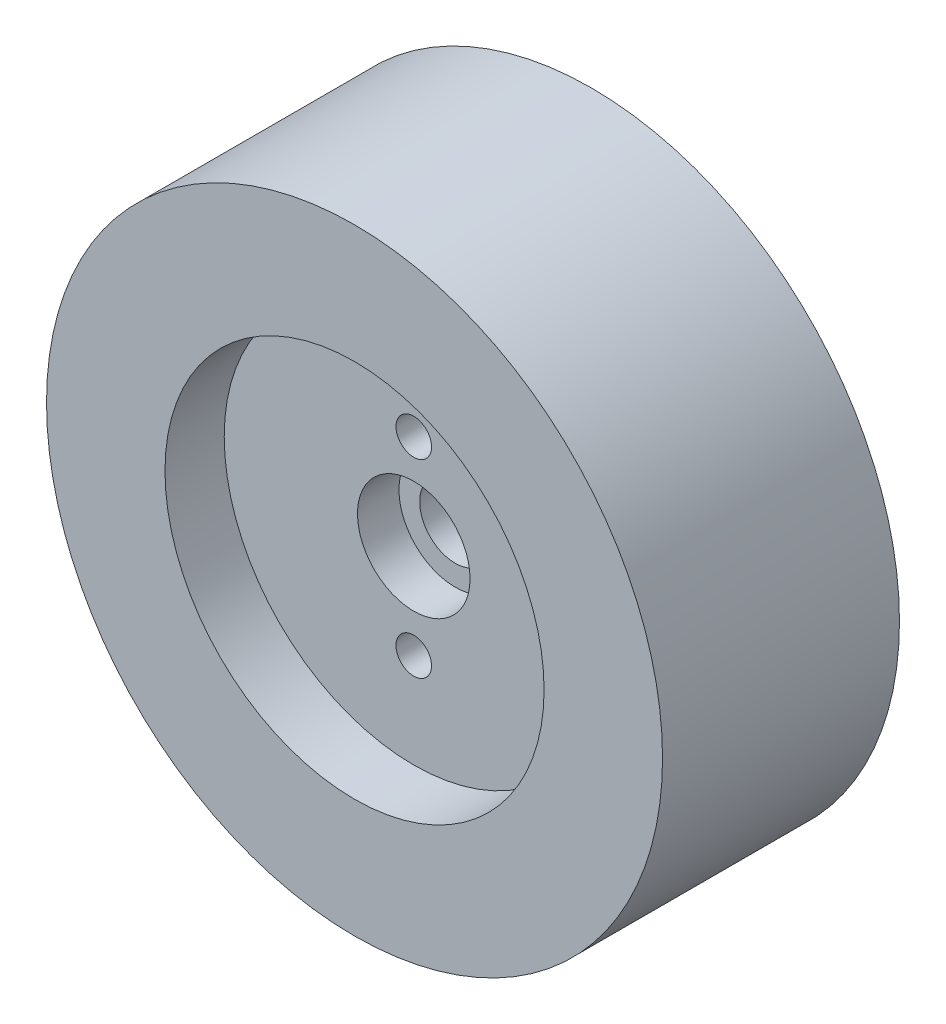
ISO-10303-21;
HEADER;
FILE_DESCRIPTION(('STEP AP214'),'2;1');
FILE_NAME('part.step','',(''),(''),'','','');
FILE_SCHEMA(('AUTOMOTIVE_DESIGN { 1 0 10303 214 1 1 1 1 }'));
ENDSEC;
DATA;
#1=APPLICATION_CONTEXT('core data for automotive mechanical design processes');
#2=APPLICATION_PROTOCOL_DEFINITION('international standard','automotive_design',2000,#1);
#3=PRODUCT_CONTEXT('',#1,'mechanical');
#4=PRODUCT('Part','Part','',(#3));
#5=PRODUCT_RELATED_PRODUCT_CATEGORY('part','',(#4));
#6=PRODUCT_DEFINITION_FORMATION('','',#4);
#7=PRODUCT_DEFINITION_CONTEXT('part definition',#1,'design');
#8=PRODUCT_DEFINITION('design','',#6,#7);
#9=PRODUCT_DEFINITION_SHAPE('','',#8);
#10=(LENGTH_UNIT() NAMED_UNIT(*) SI_UNIT(.MILLI.,.METRE.));
#11=(NAMED_UNIT(*) PLANE_ANGLE_UNIT() SI_UNIT($,.RADIAN.));
#12=(NAMED_UNIT(*) SI_UNIT($,.STERADIAN.) SOLID_ANGLE_UNIT());
#13=UNCERTAINTY_MEASURE_WITH_UNIT(LENGTH_MEASURE(1.E-05),#10,'distance_accuracy_value','');
#14=(GEOMETRIC_REPRESENTATION_CONTEXT(3) GLOBAL_UNCERTAINTY_ASSIGNED_CONTEXT((#13)) GLOBAL_UNIT_ASSIGNED_CONTEXT((#10,
#11,#12)) REPRESENTATION_CONTEXT('',''));
#15=CARTESIAN_POINT('',(0.,0.,0.));
#16=DIRECTION('',(0.,0.,1.));
#17=DIRECTION('',(1.,0.,0.));
#18=AXIS2_PLACEMENT_3D('',#15,#16,#17);
#19=CARTESIAN_POINT('',(0.,0.,20.));
#20=DIRECTION('',(0.,0.,-1.));
#21=DIRECTION('',(-1.,0.,0.));
#22=AXIS2_PLACEMENT_3D('',#19,#20,#21);
#23=CYLINDRICAL_SURFACE('',#22,3.);
#24=CARTESIAN_POINT('',(0.,0.,0.));
#25=DIRECTION('',(0.,0.,1.));
#26=DIRECTION('',(1.,0.,0.));
#27=AXIS2_PLACEMENT_3D('',#24,#25,#26);
#28=CIRCLE('',#27,3.);
#29=CARTESIAN_POINT('',(3.,0.,0.));
#30=VERTEX_POINT('',#29);
#31=EDGE_CURVE('E45',#30,#30,#28,.T.);
#32=ORIENTED_EDGE('',*,*,#31,.F.);
#33=EDGE_LOOP('',(#32));
#34=FACE_BOUND('',#33,.T.);
#35=CARTESIAN_POINT('',(0.,0.,11.5));
#36=DIRECTION('',(0.,0.,1.));
#37=DIRECTION('',(1.,0.,0.));
#38=AXIS2_PLACEMENT_3D('',#35,#36,#37);
#39=CIRCLE('',#38,3.);
#40=CARTESIAN_POINT('',(3.,0.,11.5));
#41=VERTEX_POINT('',#40);
#42=EDGE_CURVE('E36',#41,#41,#39,.T.);
#43=ORIENTED_EDGE('',*,*,#42,.T.);
#44=EDGE_LOOP('',(#43));
#45=FACE_BOUND('',#44,.T.);
#46=ADVANCED_FACE('F32',(#34,#45),#23,.F.);
#47=CARTESIAN_POINT('',(0.,0.,20.));
#48=DIRECTION('',(0.,0.,1.));
#49=DIRECTION('',(1.,0.,0.));
#50=AXIS2_PLACEMENT_3D('',#47,#48,#49);
#51=PLANE('',#50);
#52=CARTESIAN_POINT('',(0.,0.,20.));
#53=DIRECTION('',(0.,0.,1.));
#54=DIRECTION('',(1.,0.,0.));
#55=AXIS2_PLACEMENT_3D('',#52,#53,#54);
#56=CIRCLE('',#55,16.);
#57=CARTESIAN_POINT('',(16.,0.,20.));
#58=VERTEX_POINT('',#57);
#59=EDGE_CURVE('E50',#58,#58,#56,.T.);
#60=ORIENTED_EDGE('',*,*,#59,.F.);
#61=EDGE_LOOP('',(#60));
#62=FACE_BOUND('',#61,.T.);
#63=CARTESIAN_POINT('',(0.,0.,20.));
#64=DIRECTION('',(0.,0.,1.));
#65=DIRECTION('',(1.,0.,0.));
#66=AXIS2_PLACEMENT_3D('',#63,#64,#65);
#67=CIRCLE('',#66,26.);
#68=CARTESIAN_POINT('',(26.,0.,20.));
#69=VERTEX_POINT('',#68);
#70=EDGE_CURVE('E10',#69,#69,#67,.T.);
#71=ORIENTED_EDGE('',*,*,#70,.T.);
#72=EDGE_LOOP('',(#71));
#73=FACE_BOUND('',#72,.T.);
#74=ADVANCED_FACE('F101',(#62,#73),#51,.T.);
#75=CARTESIAN_POINT('',(0.,0.,0.));
#76=DIRECTION('',(0.,0.,1.));
#77=DIRECTION('',(1.,0.,0.));
#78=AXIS2_PLACEMENT_3D('',#75,#76,#77);
#79=PLANE('',#78);
#80=CARTESIAN_POINT('',(0.,-8.,0.));
#81=DIRECTION('',(0.,0.,1.));
#82=DIRECTION('',(1.,0.,0.));
#83=AXIS2_PLACEMENT_3D('',#80,#81,#82);
#84=CIRCLE('',#83,1.5);
#85=CARTESIAN_POINT('',(1.5,-8.,0.));
#86=VERTEX_POINT('',#85);
#87=EDGE_CURVE('E65',#86,#86,#84,.T.);
#88=ORIENTED_EDGE('',*,*,#87,.T.);
#89=EDGE_LOOP('',(#88));
#90=FACE_BOUND('',#89,.T.);
#91=CARTESIAN_POINT('',(0.,8.,0.));
#92=DIRECTION('',(0.,0.,1.));
#93=DIRECTION('',(1.,0.,0.));
#94=AXIS2_PLACEMENT_3D('',#91,#92,#93);
#95=CIRCLE('',#94,1.5);
#96=CARTESIAN_POINT('',(1.5,8.,0.));
#97=VERTEX_POINT('',#96);
#98=EDGE_CURVE('E59',#97,#97,#95,.T.);
#99=ORIENTED_EDGE('',*,*,#98,.T.);
#100=EDGE_LOOP('',(#99));
#101=FACE_BOUND('',#100,.T.);
#102=CARTESIAN_POINT('',(0.,0.,0.));
#103=DIRECTION('',(0.,0.,1.));
#104=DIRECTION('',(1.,0.,0.));
#105=AXIS2_PLACEMENT_3D('',#102,#103,#104);
#106=CIRCLE('',#105,26.);
#107=CARTESIAN_POINT('',(26.,0.,0.));
#108=VERTEX_POINT('',#107);
#109=EDGE_CURVE('E40',#108,#108,#106,.T.);
#110=ORIENTED_EDGE('',*,*,#109,.F.);
#111=EDGE_LOOP('',(#110));
#112=FACE_BOUND('',#111,.T.);
#113=ORIENTED_EDGE('',*,*,#31,.T.);
#114=EDGE_LOOP('',(#113));
#115=FACE_BOUND('',#114,.T.);
#116=ADVANCED_FACE('F74',(#90,#101,#112,#115),#79,.F.);
#117=CARTESIAN_POINT('',(0.,0.,20.));
#118=DIRECTION('',(0.,0.,-1.));
#119=DIRECTION('',(-1.,0.,0.));
#120=AXIS2_PLACEMENT_3D('',#117,#118,#119);
#121=CYLINDRICAL_SURFACE('',#120,26.);
#122=ORIENTED_EDGE('',*,*,#70,.F.);
#123=EDGE_LOOP('',(#122));
#124=FACE_BOUND('',#123,.T.);
#125=ORIENTED_EDGE('',*,*,#109,.T.);
#126=EDGE_LOOP('',(#125));
#127=FACE_BOUND('',#126,.T.);
#128=ADVANCED_FACE('F34',(#124,#127),#121,.T.);
#129=CARTESIAN_POINT('',(0.,0.,15.));
#130=DIRECTION('',(0.,0.,1.));
#131=DIRECTION('',(1.,0.,0.));
#132=AXIS2_PLACEMENT_3D('',#129,#130,#131);
#133=CYLINDRICAL_SURFACE('',#132,16.);
#134=CARTESIAN_POINT('',(0.,0.,15.));
#135=DIRECTION('',(0.,0.,1.));
#136=DIRECTION('',(1.,0.,0.));
#137=AXIS2_PLACEMENT_3D('',#134,#135,#136);
#138=CIRCLE('',#137,16.);
#139=CARTESIAN_POINT('',(16.,0.,15.));
#140=VERTEX_POINT('',#139);
#141=EDGE_CURVE('E49',#140,#140,#138,.T.);
#142=ORIENTED_EDGE('',*,*,#141,.F.);
#143=EDGE_LOOP('',(#142));
#144=FACE_BOUND('',#143,.T.);
#145=ORIENTED_EDGE('',*,*,#59,.T.);
#146=EDGE_LOOP('',(#145));
#147=FACE_BOUND('',#146,.T.);
#148=ADVANCED_FACE('F88',(#144,#147),#133,.F.);
#149=CARTESIAN_POINT('',(0.,0.,15.));
#150=DIRECTION('',(0.,0.,1.));
#151=DIRECTION('',(1.,0.,0.));
#152=AXIS2_PLACEMENT_3D('',#149,#150,#151);
#153=PLANE('',#152);
#154=CARTESIAN_POINT('',(0.,-8.,15.));
#155=DIRECTION('',(0.,0.,1.));
#156=DIRECTION('',(1.,0.,0.));
#157=AXIS2_PLACEMENT_3D('',#154,#155,#156);
#158=CIRCLE('',#157,1.5);
#159=CARTESIAN_POINT('',(1.5,-8.,15.));
#160=VERTEX_POINT('',#159);
#161=EDGE_CURVE('E68',#160,#160,#158,.T.);
#162=ORIENTED_EDGE('',*,*,#161,.F.);
#163=EDGE_LOOP('',(#162));
#164=FACE_BOUND('',#163,.T.);
#165=CARTESIAN_POINT('',(0.,8.,15.));
#166=DIRECTION('',(0.,0.,1.));
#167=DIRECTION('',(1.,0.,0.));
#168=AXIS2_PLACEMENT_3D('',#165,#166,#167);
#169=CIRCLE('',#168,1.5);
#170=CARTESIAN_POINT('',(1.5,8.,15.));
#171=VERTEX_POINT('',#170);
#172=EDGE_CURVE('E62',#171,#171,#169,.T.);
#173=ORIENTED_EDGE('',*,*,#172,.F.);
#174=EDGE_LOOP('',(#173));
#175=FACE_BOUND('',#174,.T.);
#176=CARTESIAN_POINT('',(0.,0.,15.));
#177=DIRECTION('',(0.,0.,1.));
#178=DIRECTION('',(1.,0.,0.));
#179=AXIS2_PLACEMENT_3D('',#176,#177,#178);
#180=CIRCLE('',#179,4.75);
#181=CARTESIAN_POINT('',(4.75,0.,15.));
#182=VERTEX_POINT('',#181);
#183=EDGE_CURVE('E55',#182,#182,#180,.T.);
#184=ORIENTED_EDGE('',*,*,#183,.F.);
#185=EDGE_LOOP('',(#184));
#186=FACE_BOUND('',#185,.T.);
#187=ORIENTED_EDGE('',*,*,#141,.T.);
#188=EDGE_LOOP('',(#187));
#189=FACE_BOUND('',#188,.T.);
#190=ADVANCED_FACE('F84',(#164,#175,#186,#189),#153,.T.);
#191=CARTESIAN_POINT('',(0.,0.,11.5));
#192=DIRECTION('',(0.,0.,1.));
#193=DIRECTION('',(1.,0.,0.));
#194=AXIS2_PLACEMENT_3D('',#191,#192,#193);
#195=CYLINDRICAL_SURFACE('',#194,4.75);
#196=CARTESIAN_POINT('',(0.,0.,11.5));
#197=DIRECTION('',(0.,0.,1.));
#198=DIRECTION('',(1.,0.,0.));
#199=AXIS2_PLACEMENT_3D('',#196,#197,#198);
#200=CIRCLE('',#199,4.75);
#201=CARTESIAN_POINT('',(4.75,0.,11.5));
#202=VERTEX_POINT('',#201);
#203=EDGE_CURVE('E58',#202,#202,#200,.T.);
#204=ORIENTED_EDGE('',*,*,#203,.F.);
#205=EDGE_LOOP('',(#204));
#206=FACE_BOUND('',#205,.T.);
#207=ORIENTED_EDGE('',*,*,#183,.T.);
#208=EDGE_LOOP('',(#207));
#209=FACE_BOUND('',#208,.T.);
#210=ADVANCED_FACE('F87',(#206,#209),#195,.F.);
#211=CARTESIAN_POINT('',(0.,0.,11.5));
#212=DIRECTION('',(0.,0.,1.));
#213=DIRECTION('',(1.,0.,0.));
#214=AXIS2_PLACEMENT_3D('',#211,#212,#213);
#215=PLANE('',#214);
#216=ORIENTED_EDGE('',*,*,#42,.F.);
#217=EDGE_LOOP('',(#216));
#218=FACE_BOUND('',#217,.T.);
#219=ORIENTED_EDGE('',*,*,#203,.T.);
#220=EDGE_LOOP('',(#219));
#221=FACE_BOUND('',#220,.T.);
#222=ADVANCED_FACE('F113',(#218,#221),#215,.T.);
#223=CARTESIAN_POINT('',(0.,8.,0.));
#224=DIRECTION('',(0.,0.,1.));
#225=DIRECTION('',(1.,0.,0.));
#226=AXIS2_PLACEMENT_3D('',#223,#224,#225);
#227=CYLINDRICAL_SURFACE('',#226,1.5);
#228=ORIENTED_EDGE('',*,*,#98,.F.);
#229=EDGE_LOOP('',(#228));
#230=FACE_BOUND('',#229,.T.);
#231=ORIENTED_EDGE('',*,*,#172,.T.);
#232=EDGE_LOOP('',(#231));
#233=FACE_BOUND('',#232,.T.);
#234=ADVANCED_FACE('F80',(#230,#233),#227,.F.);
#235=CARTESIAN_POINT('',(0.,-8.,0.));
#236=DIRECTION('',(0.,0.,1.));
#237=DIRECTION('',(1.,0.,0.));
#238=AXIS2_PLACEMENT_3D('',#235,#236,#237);
#239=CYLINDRICAL_SURFACE('',#238,1.5);
#240=ORIENTED_EDGE('',*,*,#87,.F.);
#241=EDGE_LOOP('',(#240));
#242=FACE_BOUND('',#241,.T.);
#243=ORIENTED_EDGE('',*,*,#161,.T.);
#244=EDGE_LOOP('',(#243));
#245=FACE_BOUND('',#244,.T.);
#246=ADVANCED_FACE('F77',(#242,#245),#239,.F.);
#247=CLOSED_SHELL('',(#46,#74,#116,#128,#148,#190,#210,#222,#234,#246));
#248=MANIFOLD_SOLID_BREP('B2',#247);
#249=ADVANCED_BREP_SHAPE_REPRESENTATION('',(#18,#248),#14);
#250=SHAPE_DEFINITION_REPRESENTATION(#9,#249);
ENDSEC;
END-ISO-10303-21;
